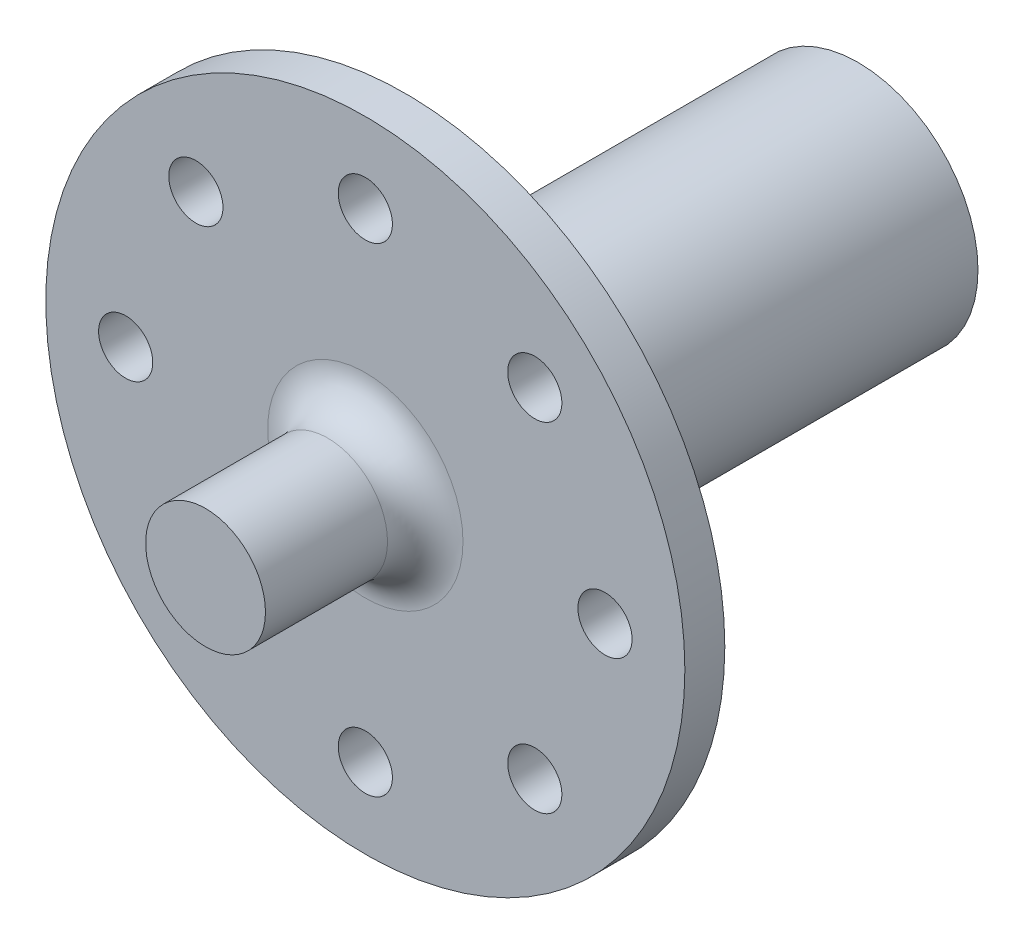
ISO-10303-21;
HEADER;
FILE_DESCRIPTION(('STEP AP214'),'2;1');
FILE_NAME('part.step','',(''),(''),'','','');
FILE_SCHEMA(('AUTOMOTIVE_DESIGN { 1 0 10303 214 1 1 1 1 }'));
ENDSEC;
DATA;
#1=APPLICATION_CONTEXT('core data for automotive mechanical design processes');
#2=APPLICATION_PROTOCOL_DEFINITION('international standard','automotive_design',2000,#1);
#3=PRODUCT_CONTEXT('',#1,'mechanical');
#4=PRODUCT('Part','Part','',(#3));
#5=PRODUCT_RELATED_PRODUCT_CATEGORY('part','',(#4));
#6=PRODUCT_DEFINITION_FORMATION('','',#4);
#7=PRODUCT_DEFINITION_CONTEXT('part definition',#1,'design');
#8=PRODUCT_DEFINITION('design','',#6,#7);
#9=PRODUCT_DEFINITION_SHAPE('','',#8);
#10=(LENGTH_UNIT() NAMED_UNIT(*) SI_UNIT(.MILLI.,.METRE.));
#11=(NAMED_UNIT(*) PLANE_ANGLE_UNIT() SI_UNIT($,.RADIAN.));
#12=(NAMED_UNIT(*) SI_UNIT($,.STERADIAN.) SOLID_ANGLE_UNIT());
#13=UNCERTAINTY_MEASURE_WITH_UNIT(LENGTH_MEASURE(1.E-05),#10,'distance_accuracy_value','');
#14=(GEOMETRIC_REPRESENTATION_CONTEXT(3) GLOBAL_UNCERTAINTY_ASSIGNED_CONTEXT((#13)) GLOBAL_UNIT_ASSIGNED_CONTEXT((#10,
#11,#12)) REPRESENTATION_CONTEXT('',''));
#15=CARTESIAN_POINT('',(0.,0.,0.));
#16=DIRECTION('',(0.,0.,1.));
#17=DIRECTION('',(1.,0.,0.));
#18=AXIS2_PLACEMENT_3D('',#15,#16,#17);
#19=CARTESIAN_POINT('',(-1.5,5.2,36.));
#20=DIRECTION('',(1.,0.,0.));
#21=DIRECTION('',(0.,0.,-1.));
#22=AXIS2_PLACEMENT_3D('',#19,#20,#21);
#23=PLANE('',#22);
#24=DIRECTION('',(0.,0.,-1.));
#25=VECTOR('',#24,1.);
#26=CARTESIAN_POINT('',(-1.5,5.2,36.));
#27=LINE('',#26,#25);
#28=CARTESIAN_POINT('',(-1.5,5.2,25.4));
#29=VERTEX_POINT('',#28);
#30=CARTESIAN_POINT('',(-1.5,5.2,0.));
#31=VERTEX_POINT('',#30);
#32=EDGE_CURVE('E108',#29,#31,#27,.T.);
#33=ORIENTED_EDGE('',*,*,#32,.F.);
#34=DIRECTION('',(0.,-1.,0.));
#35=VECTOR('',#34,1.);
#36=CARTESIAN_POINT('',(-1.5,5.2,25.4));
#37=LINE('',#36,#35);
#38=CARTESIAN_POINT('',(-1.5,3.70809924354783,25.4));
#39=VERTEX_POINT('',#38);
#40=EDGE_CURVE('E57',#29,#39,#37,.T.);
#41=ORIENTED_EDGE('',*,*,#40,.T.);
#42=DIRECTION('',(0.,0.,-1.));
#43=VECTOR('',#42,1.);
#44=CARTESIAN_POINT('',(-1.5,3.70809924354783,36.));
#45=LINE('',#44,#43);
#46=CARTESIAN_POINT('',(-1.5,3.70809924354783,0.));
#47=VERTEX_POINT('',#46);
#48=EDGE_CURVE('E96',#39,#47,#45,.T.);
#49=ORIENTED_EDGE('',*,*,#48,.T.);
#50=DIRECTION('',(0.,-1.,0.));
#51=VECTOR('',#50,1.);
#52=CARTESIAN_POINT('',(-1.5,5.2,0.));
#53=LINE('',#52,#51);
#54=EDGE_CURVE('E195',#31,#47,#53,.T.);
#55=ORIENTED_EDGE('',*,*,#54,.F.);
#56=EDGE_LOOP('',(#33,#41,#49,#55));
#57=FACE_BOUND('',#56,.T.);
#58=ADVANCED_FACE('F41',(#57),#23,.T.);
#59=CARTESIAN_POINT('',(1.5,5.2,36.));
#60=DIRECTION('',(-1.,0.,0.));
#61=DIRECTION('',(0.,0.,1.));
#62=AXIS2_PLACEMENT_3D('',#59,#60,#61);
#63=PLANE('',#62);
#64=DIRECTION('',(0.,0.,-1.));
#65=VECTOR('',#64,1.);
#66=CARTESIAN_POINT('',(1.5,3.70809924354783,36.));
#67=LINE('',#66,#65);
#68=CARTESIAN_POINT('',(1.5,3.70809924354783,25.4));
#69=VERTEX_POINT('',#68);
#70=CARTESIAN_POINT('',(1.5,3.70809924354783,0.));
#71=VERTEX_POINT('',#70);
#72=EDGE_CURVE('E65',#69,#71,#67,.T.);
#73=ORIENTED_EDGE('',*,*,#72,.F.);
#74=DIRECTION('',(0.,1.,0.));
#75=VECTOR('',#74,1.);
#76=CARTESIAN_POINT('',(1.5,3.70809924354783,25.4));
#77=LINE('',#76,#75);
#78=CARTESIAN_POINT('',(1.5,5.2,25.4));
#79=VERTEX_POINT('',#78);
#80=EDGE_CURVE('E276',#69,#79,#77,.T.);
#81=ORIENTED_EDGE('',*,*,#80,.T.);
#82=DIRECTION('',(0.,0.,-1.));
#83=VECTOR('',#82,1.);
#84=CARTESIAN_POINT('',(1.5,5.2,36.));
#85=LINE('',#84,#83);
#86=CARTESIAN_POINT('',(1.5,5.2,0.));
#87=VERTEX_POINT('',#86);
#88=EDGE_CURVE('E215',#79,#87,#85,.T.);
#89=ORIENTED_EDGE('',*,*,#88,.T.);
#90=DIRECTION('',(0.,1.,0.));
#91=VECTOR('',#90,1.);
#92=CARTESIAN_POINT('',(1.5,5.2,0.));
#93=LINE('',#92,#91);
#94=EDGE_CURVE('E206',#71,#87,#93,.T.);
#95=ORIENTED_EDGE('',*,*,#94,.F.);
#96=EDGE_LOOP('',(#73,#81,#89,#95));
#97=FACE_BOUND('',#96,.T.);
#98=ADVANCED_FACE('F247',(#97),#63,.T.);
#99=CARTESIAN_POINT('',(-1.5,5.2,36.));
#100=DIRECTION('',(0.,-1.,0.));
#101=DIRECTION('',(0.,0.,-1.));
#102=AXIS2_PLACEMENT_3D('',#99,#100,#101);
#103=PLANE('',#102);
#104=ORIENTED_EDGE('',*,*,#88,.F.);
#105=DIRECTION('',(-1.,0.,0.));
#106=VECTOR('',#105,1.);
#107=CARTESIAN_POINT('',(1.5,5.2,25.4));
#108=LINE('',#107,#106);
#109=EDGE_CURVE('E119',#79,#29,#108,.T.);
#110=ORIENTED_EDGE('',*,*,#109,.T.);
#111=ORIENTED_EDGE('',*,*,#32,.T.);
#112=DIRECTION('',(-1.,0.,0.));
#113=VECTOR('',#112,1.);
#114=CARTESIAN_POINT('',(-1.5,5.2,0.));
#115=LINE('',#114,#113);
#116=EDGE_CURVE('E109',#87,#31,#115,.T.);
#117=ORIENTED_EDGE('',*,*,#116,.F.);
#118=EDGE_LOOP('',(#104,#110,#111,#117));
#119=FACE_BOUND('',#118,.T.);
#120=ADVANCED_FACE('F252',(#119),#103,.T.);
#121=CARTESIAN_POINT('',(0.,0.,36.));
#122=DIRECTION('',(0.,0.,1.));
#123=DIRECTION('',(1.,0.,0.));
#124=AXIS2_PLACEMENT_3D('',#121,#122,#123);
#125=PLANE('',#124);
#126=DIRECTION('',(-1.,0.,0.));
#127=VECTOR('',#126,1.);
#128=CARTESIAN_POINT('',(1.5,3.70809924354783,36.));
#129=LINE('',#128,#127);
#130=CARTESIAN_POINT('',(1.5,3.70809924354783,36.));
#131=VERTEX_POINT('',#130);
#132=CARTESIAN_POINT('',(-1.5,3.70809924354783,36.));
#133=VERTEX_POINT('',#132);
#134=EDGE_CURVE('E106',#131,#133,#129,.T.);
#135=ORIENTED_EDGE('',*,*,#134,.F.);
#136=CARTESIAN_POINT('',(0.,0.,36.));
#137=DIRECTION('',(0.,0.,1.));
#138=DIRECTION('',(1.,0.,0.));
#139=AXIS2_PLACEMENT_3D('',#136,#137,#138);
#140=CIRCLE('',#139,4.);
#141=EDGE_CURVE('E94',#133,#131,#140,.T.);
#142=ORIENTED_EDGE('',*,*,#141,.F.);
#143=EDGE_LOOP('',(#135,#142));
#144=FACE_BOUND('',#143,.T.);
#145=ADVANCED_FACE('F105',(#144),#125,.F.);
#146=CARTESIAN_POINT('',(0.,0.,0.));
#147=DIRECTION('',(0.,0.,1.));
#148=DIRECTION('',(1.,0.,0.));
#149=AXIS2_PLACEMENT_3D('',#146,#147,#148);
#150=PLANE('',#149);
#151=CARTESIAN_POINT('',(0.,0.,0.));
#152=DIRECTION('',(0.,0.,1.));
#153=DIRECTION('',(1.,0.,0.));
#154=AXIS2_PLACEMENT_3D('',#151,#152,#153);
#155=CIRCLE('',#154,9.525);
#156=CARTESIAN_POINT('',(9.525,0.,0.));
#157=VERTEX_POINT('',#156);
#158=EDGE_CURVE('E102',#157,#157,#155,.T.);
#159=ORIENTED_EDGE('',*,*,#158,.F.);
#160=EDGE_LOOP('',(#159));
#161=FACE_BOUND('',#160,.T.);
#162=ORIENTED_EDGE('',*,*,#54,.T.);
#163=CARTESIAN_POINT('',(0.,0.,0.));
#164=DIRECTION('',(0.,0.,1.));
#165=DIRECTION('',(1.,0.,0.));
#166=AXIS2_PLACEMENT_3D('',#163,#164,#165);
#167=CIRCLE('',#166,4.);
#168=EDGE_CURVE('E202',#47,#71,#167,.T.);
#169=ORIENTED_EDGE('',*,*,#168,.T.);
#170=ORIENTED_EDGE('',*,*,#94,.T.);
#171=ORIENTED_EDGE('',*,*,#116,.T.);
#172=EDGE_LOOP('',(#162,#169,#170,#171));
#173=FACE_BOUND('',#172,.T.);
#174=ADVANCED_FACE('F256',(#161,#173),#150,.F.);
#175=CARTESIAN_POINT('',(0.,0.,36.));
#176=DIRECTION('',(0.,0.,-1.));
#177=DIRECTION('',(-1.,0.,0.));
#178=AXIS2_PLACEMENT_3D('',#175,#176,#177);
#179=CYLINDRICAL_SURFACE('',#178,9.525);
#180=CARTESIAN_POINT('',(0.,0.,36.));
#181=DIRECTION('',(0.,0.,1.));
#182=DIRECTION('',(1.,0.,0.));
#183=AXIS2_PLACEMENT_3D('',#180,#181,#182);
#184=CIRCLE('',#183,9.525);
#185=CARTESIAN_POINT('',(9.525,0.,36.));
#186=VERTEX_POINT('',#185);
#187=EDGE_CURVE('E220',#186,#186,#184,.T.);
#188=ORIENTED_EDGE('',*,*,#187,.F.);
#189=EDGE_LOOP('',(#188));
#190=FACE_BOUND('',#189,.T.);
#191=ORIENTED_EDGE('',*,*,#158,.T.);
#192=EDGE_LOOP('',(#191));
#193=FACE_BOUND('',#192,.T.);
#194=ADVANCED_FACE('F258',(#190,#193),#179,.T.);
#195=CARTESIAN_POINT('',(0.,0.,36.));
#196=DIRECTION('',(0.,0.,-1.));
#197=DIRECTION('',(-1.,0.,0.));
#198=AXIS2_PLACEMENT_3D('',#195,#196,#197);
#199=CYLINDRICAL_SURFACE('',#198,4.);
#200=ORIENTED_EDGE('',*,*,#168,.F.);
#201=ORIENTED_EDGE('',*,*,#48,.F.);
#202=EDGE_CURVE('E90',#133,#39,#45,.T.);
#203=ORIENTED_EDGE('',*,*,#202,.F.);
#204=ORIENTED_EDGE('',*,*,#141,.T.);
#205=EDGE_CURVE('E112',#131,#69,#67,.T.);
#206=ORIENTED_EDGE('',*,*,#205,.T.);
#207=ORIENTED_EDGE('',*,*,#72,.T.);
#208=EDGE_LOOP('',(#200,#201,#203,#204,#206,#207));
#209=FACE_BOUND('',#208,.T.);
#210=ADVANCED_FACE('F93',(#209),#199,.F.);
#211=CARTESIAN_POINT('',(0.,19.05,36.));
#212=DIRECTION('',(0.,0.,1.));
#213=DIRECTION('',(1.,0.,0.));
#214=AXIS2_PLACEMENT_3D('',#211,#212,#213);
#215=CIRCLE('',#214,2.15265);
#216=CARTESIAN_POINT('',(2.15265,19.05,36.));
#217=VERTEX_POINT('',#216);
#218=EDGE_CURVE('E182',#217,#217,#215,.T.);
#219=ORIENTED_EDGE('',*,*,#218,.T.);
#220=EDGE_LOOP('',(#219));
#221=FACE_BOUND('',#220,.T.);
#222=CARTESIAN_POINT('',(-13.4703841816037,13.4703841816038,36.));
#223=DIRECTION('',(0.,0.,1.));
#224=DIRECTION('',(1.,0.,0.));
#225=AXIS2_PLACEMENT_3D('',#222,#223,#224);
#226=CIRCLE('',#225,2.15265);
#227=CARTESIAN_POINT('',(-11.3177341816037,13.4703841816038,36.));
#228=VERTEX_POINT('',#227);
#229=EDGE_CURVE('E178',#228,#228,#226,.T.);
#230=ORIENTED_EDGE('',*,*,#229,.T.);
#231=EDGE_LOOP('',(#230));
#232=FACE_BOUND('',#231,.T.);
#233=CARTESIAN_POINT('',(-13.4703841816037,-13.4703841816038,36.));
#234=DIRECTION('',(0.,0.,1.));
#235=DIRECTION('',(1.,0.,0.));
#236=AXIS2_PLACEMENT_3D('',#233,#234,#235);
#237=CIRCLE('',#236,2.15265);
#238=CARTESIAN_POINT('',(-11.3177341816037,-13.4703841816038,36.));
#239=VERTEX_POINT('',#238);
#240=EDGE_CURVE('E174',#239,#239,#237,.T.);
#241=ORIENTED_EDGE('',*,*,#240,.T.);
#242=EDGE_LOOP('',(#241));
#243=FACE_BOUND('',#242,.T.);
#244=CARTESIAN_POINT('',(0.,-19.05,36.));
#245=DIRECTION('',(0.,0.,1.));
#246=DIRECTION('',(1.,0.,0.));
#247=AXIS2_PLACEMENT_3D('',#244,#245,#246);
#248=CIRCLE('',#247,2.15265);
#249=CARTESIAN_POINT('',(2.15265,-19.05,36.));
#250=VERTEX_POINT('',#249);
#251=EDGE_CURVE('E170',#250,#250,#248,.T.);
#252=ORIENTED_EDGE('',*,*,#251,.T.);
#253=EDGE_LOOP('',(#252));
#254=FACE_BOUND('',#253,.T.);
#255=CARTESIAN_POINT('',(13.4703841816037,13.4703841816038,36.));
#256=DIRECTION('',(0.,0.,1.));
#257=DIRECTION('',(1.,0.,0.));
#258=AXIS2_PLACEMENT_3D('',#255,#256,#257);
#259=CIRCLE('',#258,2.15265);
#260=CARTESIAN_POINT('',(15.6230341816037,13.4703841816038,36.));
#261=VERTEX_POINT('',#260);
#262=EDGE_CURVE('E166',#261,#261,#259,.T.);
#263=ORIENTED_EDGE('',*,*,#262,.T.);
#264=EDGE_LOOP('',(#263));
#265=FACE_BOUND('',#264,.T.);
#266=CARTESIAN_POINT('',(19.05,0.,36.));
#267=DIRECTION('',(0.,0.,1.));
#268=DIRECTION('',(1.,0.,0.));
#269=AXIS2_PLACEMENT_3D('',#266,#267,#268);
#270=CIRCLE('',#269,2.15265);
#271=CARTESIAN_POINT('',(21.20265,0.,36.));
#272=VERTEX_POINT('',#271);
#273=EDGE_CURVE('E162',#272,#272,#270,.T.);
#274=ORIENTED_EDGE('',*,*,#273,.T.);
#275=EDGE_LOOP('',(#274));
#276=FACE_BOUND('',#275,.T.);
#277=CARTESIAN_POINT('',(13.4703841816037,-13.4703841816038,36.));
#278=DIRECTION('',(0.,0.,1.));
#279=DIRECTION('',(1.,0.,0.));
#280=AXIS2_PLACEMENT_3D('',#277,#278,#279);
#281=CIRCLE('',#280,2.15265);
#282=CARTESIAN_POINT('',(15.6230341816037,-13.4703841816038,36.));
#283=VERTEX_POINT('',#282);
#284=EDGE_CURVE('E158',#283,#283,#281,.T.);
#285=ORIENTED_EDGE('',*,*,#284,.T.);
#286=EDGE_LOOP('',(#285));
#287=FACE_BOUND('',#286,.T.);
#288=CARTESIAN_POINT('',(-19.05,0.,36.));
#289=DIRECTION('',(0.,0.,1.));
#290=DIRECTION('',(1.,0.,0.));
#291=AXIS2_PLACEMENT_3D('',#288,#289,#290);
#292=CIRCLE('',#291,2.15265);
#293=CARTESIAN_POINT('',(-16.89735,0.,36.));
#294=VERTEX_POINT('',#293);
#295=EDGE_CURVE('E126',#294,#294,#292,.T.);
#296=ORIENTED_EDGE('',*,*,#295,.T.);
#297=EDGE_LOOP('',(#296));
#298=FACE_BOUND('',#297,.T.);
#299=CARTESIAN_POINT('',(0.,0.,36.));
#300=DIRECTION('',(0.,0.,1.));
#301=DIRECTION('',(1.,0.,0.));
#302=AXIS2_PLACEMENT_3D('',#299,#300,#301);
#303=CIRCLE('',#302,25.4);
#304=CARTESIAN_POINT('',(25.4,0.,36.));
#305=VERTEX_POINT('',#304);
#306=EDGE_CURVE('E190',#305,#305,#303,.T.);
#307=ORIENTED_EDGE('',*,*,#306,.F.);
#308=EDGE_LOOP('',(#307));
#309=FACE_BOUND('',#308,.T.);
#310=ORIENTED_EDGE('',*,*,#187,.T.);
#311=EDGE_LOOP('',(#310));
#312=FACE_BOUND('',#311,.T.);
#313=ADVANCED_FACE('F265',(#221,#232,#243,#254,#265,#276,#287,#298,#309,#312),#125,.F.);
#314=CARTESIAN_POINT('',(0.,0.,39.175));
#315=DIRECTION('',(0.,0.,-1.));
#316=DIRECTION('',(-1.,0.,0.));
#317=AXIS2_PLACEMENT_3D('',#314,#315,#316);
#318=CYLINDRICAL_SURFACE('',#317,25.4);
#319=CARTESIAN_POINT('',(0.,0.,39.175));
#320=DIRECTION('',(0.,0.,1.));
#321=DIRECTION('',(1.,0.,0.));
#322=AXIS2_PLACEMENT_3D('',#319,#320,#321);
#323=CIRCLE('',#322,25.4);
#324=CARTESIAN_POINT('',(25.4,0.,39.175));
#325=VERTEX_POINT('',#324);
#326=EDGE_CURVE('E191',#325,#325,#323,.T.);
#327=ORIENTED_EDGE('',*,*,#326,.F.);
#328=EDGE_LOOP('',(#327));
#329=FACE_BOUND('',#328,.T.);
#330=ORIENTED_EDGE('',*,*,#306,.T.);
#331=EDGE_LOOP('',(#330));
#332=FACE_BOUND('',#331,.T.);
#333=ADVANCED_FACE('F325',(#329,#332),#318,.T.);
#334=CARTESIAN_POINT('',(0.,0.,39.175));
#335=DIRECTION('',(0.,0.,1.));
#336=DIRECTION('',(1.,0.,0.));
#337=AXIS2_PLACEMENT_3D('',#334,#335,#336);
#338=PLANE('',#337);
#339=CARTESIAN_POINT('',(0.,0.,39.175));
#340=DIRECTION('',(0.,0.,1.));
#341=DIRECTION('',(1.,0.,0.));
#342=AXIS2_PLACEMENT_3D('',#339,#340,#341);
#343=CIRCLE('',#342,7.7625);
#344=CARTESIAN_POINT('',(7.7625,0.,39.175));
#345=VERTEX_POINT('',#344);
#346=EDGE_CURVE('E12',#345,#345,#343,.F.);
#347=ORIENTED_EDGE('',*,*,#346,.T.);
#348=EDGE_LOOP('',(#347));
#349=FACE_BOUND('',#348,.T.);
#350=CARTESIAN_POINT('',(0.,19.05,39.175));
#351=DIRECTION('',(0.,0.,1.));
#352=DIRECTION('',(1.,0.,0.));
#353=AXIS2_PLACEMENT_3D('',#350,#351,#352);
#354=CIRCLE('',#353,2.15265);
#355=CARTESIAN_POINT('',(2.15265,19.05,39.175));
#356=VERTEX_POINT('',#355);
#357=EDGE_CURVE('E122',#356,#356,#354,.T.);
#358=ORIENTED_EDGE('',*,*,#357,.F.);
#359=EDGE_LOOP('',(#358));
#360=FACE_BOUND('',#359,.T.);
#361=CARTESIAN_POINT('',(-13.4703841816037,13.4703841816038,39.175));
#362=DIRECTION('',(0.,0.,1.));
#363=DIRECTION('',(1.,0.,0.));
#364=AXIS2_PLACEMENT_3D('',#361,#362,#363);
#365=CIRCLE('',#364,2.15265);
#366=CARTESIAN_POINT('',(-11.3177341816037,13.4703841816038,39.175));
#367=VERTEX_POINT('',#366);
#368=EDGE_CURVE('E137',#367,#367,#365,.T.);
#369=ORIENTED_EDGE('',*,*,#368,.F.);
#370=EDGE_LOOP('',(#369));
#371=FACE_BOUND('',#370,.T.);
#372=CARTESIAN_POINT('',(-13.4703841816037,-13.4703841816038,39.175));
#373=DIRECTION('',(0.,0.,1.));
#374=DIRECTION('',(1.,0.,0.));
#375=AXIS2_PLACEMENT_3D('',#372,#373,#374);
#376=CIRCLE('',#375,2.15265);
#377=CARTESIAN_POINT('',(-11.3177341816037,-13.4703841816038,39.175));
#378=VERTEX_POINT('',#377);
#379=EDGE_CURVE('E133',#378,#378,#376,.T.);
#380=ORIENTED_EDGE('',*,*,#379,.F.);
#381=EDGE_LOOP('',(#380));
#382=FACE_BOUND('',#381,.T.);
#383=CARTESIAN_POINT('',(0.,-19.05,39.175));
#384=DIRECTION('',(0.,0.,1.));
#385=DIRECTION('',(1.,0.,0.));
#386=AXIS2_PLACEMENT_3D('',#383,#384,#385);
#387=CIRCLE('',#386,2.15265);
#388=CARTESIAN_POINT('',(2.15265,-19.05,39.175));
#389=VERTEX_POINT('',#388);
#390=EDGE_CURVE('E128',#389,#389,#387,.T.);
#391=ORIENTED_EDGE('',*,*,#390,.F.);
#392=EDGE_LOOP('',(#391));
#393=FACE_BOUND('',#392,.T.);
#394=CARTESIAN_POINT('',(13.4703841816037,13.4703841816038,39.175));
#395=DIRECTION('',(0.,0.,1.));
#396=DIRECTION('',(1.,0.,0.));
#397=AXIS2_PLACEMENT_3D('',#394,#395,#396);
#398=CIRCLE('',#397,2.15265);
#399=CARTESIAN_POINT('',(15.6230341816037,13.4703841816038,39.175));
#400=VERTEX_POINT('',#399);
#401=EDGE_CURVE('E127',#400,#400,#398,.T.);
#402=ORIENTED_EDGE('',*,*,#401,.F.);
#403=EDGE_LOOP('',(#402));
#404=FACE_BOUND('',#403,.T.);
#405=CARTESIAN_POINT('',(19.05,0.,39.175));
#406=DIRECTION('',(0.,0.,1.));
#407=DIRECTION('',(1.,0.,0.));
#408=AXIS2_PLACEMENT_3D('',#405,#406,#407);
#409=CIRCLE('',#408,2.15265);
#410=CARTESIAN_POINT('',(21.20265,0.,39.175));
#411=VERTEX_POINT('',#410);
#412=EDGE_CURVE('E145',#411,#411,#409,.T.);
#413=ORIENTED_EDGE('',*,*,#412,.F.);
#414=EDGE_LOOP('',(#413));
#415=FACE_BOUND('',#414,.T.);
#416=CARTESIAN_POINT('',(13.4703841816037,-13.4703841816038,39.175));
#417=DIRECTION('',(0.,0.,1.));
#418=DIRECTION('',(1.,0.,0.));
#419=AXIS2_PLACEMENT_3D('',#416,#417,#418);
#420=CIRCLE('',#419,2.15265);
#421=CARTESIAN_POINT('',(15.6230341816037,-13.4703841816038,39.175));
#422=VERTEX_POINT('',#421);
#423=EDGE_CURVE('E141',#422,#422,#420,.T.);
#424=ORIENTED_EDGE('',*,*,#423,.F.);
#425=EDGE_LOOP('',(#424));
#426=FACE_BOUND('',#425,.T.);
#427=CARTESIAN_POINT('',(-19.05,0.,39.175));
#428=DIRECTION('',(0.,0.,1.));
#429=DIRECTION('',(1.,0.,0.));
#430=AXIS2_PLACEMENT_3D('',#427,#428,#429);
#431=CIRCLE('',#430,2.15265);
#432=CARTESIAN_POINT('',(-16.89735,0.,39.175));
#433=VERTEX_POINT('',#432);
#434=EDGE_CURVE('E132',#433,#433,#431,.T.);
#435=ORIENTED_EDGE('',*,*,#434,.F.);
#436=EDGE_LOOP('',(#435));
#437=FACE_BOUND('',#436,.T.);
#438=ORIENTED_EDGE('',*,*,#326,.T.);
#439=EDGE_LOOP('',(#438));
#440=FACE_BOUND('',#439,.T.);
#441=ADVANCED_FACE('F322',(#349,#360,#371,#382,#393,#404,#415,#426,#437,#440),#338,.T.);
#442=CARTESIAN_POINT('',(0.,0.,51.875));
#443=DIRECTION('',(0.,0.,-1.));
#444=DIRECTION('',(-1.,0.,0.));
#445=AXIS2_PLACEMENT_3D('',#442,#443,#444);
#446=CYLINDRICAL_SURFACE('',#445,4.7625);
#447=CARTESIAN_POINT('',(0.,0.,42.175));
#448=DIRECTION('',(0.,0.,1.));
#449=DIRECTION('',(1.,0.,0.));
#450=AXIS2_PLACEMENT_3D('',#447,#448,#449);
#451=CIRCLE('',#450,4.7625);
#452=CARTESIAN_POINT('',(4.7625,0.,42.175));
#453=VERTEX_POINT('',#452);
#454=EDGE_CURVE('E50',#453,#453,#451,.T.);
#455=ORIENTED_EDGE('',*,*,#454,.T.);
#456=EDGE_LOOP('',(#455));
#457=FACE_BOUND('',#456,.T.);
#458=CARTESIAN_POINT('',(0.,0.,51.875));
#459=DIRECTION('',(0.,0.,1.));
#460=DIRECTION('',(1.,0.,0.));
#461=AXIS2_PLACEMENT_3D('',#458,#459,#460);
#462=CIRCLE('',#461,4.7625);
#463=CARTESIAN_POINT('',(4.7625,0.,51.875));
#464=VERTEX_POINT('',#463);
#465=EDGE_CURVE('E186',#464,#464,#462,.T.);
#466=ORIENTED_EDGE('',*,*,#465,.F.);
#467=EDGE_LOOP('',(#466));
#468=FACE_BOUND('',#467,.T.);
#469=ADVANCED_FACE('F230',(#457,#468),#446,.T.);
#470=CARTESIAN_POINT('',(0.,0.,51.875));
#471=DIRECTION('',(0.,0.,1.));
#472=DIRECTION('',(1.,0.,0.));
#473=AXIS2_PLACEMENT_3D('',#470,#471,#472);
#474=PLANE('',#473);
#475=ORIENTED_EDGE('',*,*,#465,.T.);
#476=EDGE_LOOP('',(#475));
#477=FACE_BOUND('',#476,.T.);
#478=ADVANCED_FACE('F309',(#477),#474,.T.);
#479=CARTESIAN_POINT('',(-19.05,0.,20.125));
#480=DIRECTION('',(0.,0.,1.));
#481=DIRECTION('',(1.,0.,0.));
#482=AXIS2_PLACEMENT_3D('',#479,#480,#481);
#483=CYLINDRICAL_SURFACE('',#482,2.15265);
#484=ORIENTED_EDGE('',*,*,#434,.T.);
#485=EDGE_LOOP('',(#484));
#486=FACE_BOUND('',#485,.T.);
#487=ORIENTED_EDGE('',*,*,#295,.F.);
#488=EDGE_LOOP('',(#487));
#489=FACE_BOUND('',#488,.T.);
#490=ADVANCED_FACE('F305',(#486,#489),#483,.F.);
#491=CARTESIAN_POINT('',(13.4703841816037,-13.4703841816038,20.125));
#492=DIRECTION('',(0.,0.,1.));
#493=DIRECTION('',(1.,0.,0.));
#494=AXIS2_PLACEMENT_3D('',#491,#492,#493);
#495=CYLINDRICAL_SURFACE('',#494,2.15265);
#496=ORIENTED_EDGE('',*,*,#423,.T.);
#497=EDGE_LOOP('',(#496));
#498=FACE_BOUND('',#497,.T.);
#499=ORIENTED_EDGE('',*,*,#284,.F.);
#500=EDGE_LOOP('',(#499));
#501=FACE_BOUND('',#500,.T.);
#502=ADVANCED_FACE('F301',(#498,#501),#495,.F.);
#503=CARTESIAN_POINT('',(19.05,0.,20.125));
#504=DIRECTION('',(0.,0.,1.));
#505=DIRECTION('',(1.,0.,0.));
#506=AXIS2_PLACEMENT_3D('',#503,#504,#505);
#507=CYLINDRICAL_SURFACE('',#506,2.15265);
#508=ORIENTED_EDGE('',*,*,#412,.T.);
#509=EDGE_LOOP('',(#508));
#510=FACE_BOUND('',#509,.T.);
#511=ORIENTED_EDGE('',*,*,#273,.F.);
#512=EDGE_LOOP('',(#511));
#513=FACE_BOUND('',#512,.T.);
#514=ADVANCED_FACE('F304',(#510,#513),#507,.F.);
#515=CARTESIAN_POINT('',(13.4703841816037,13.4703841816038,20.125));
#516=DIRECTION('',(0.,0.,1.));
#517=DIRECTION('',(1.,0.,0.));
#518=AXIS2_PLACEMENT_3D('',#515,#516,#517);
#519=CYLINDRICAL_SURFACE('',#518,2.15265);
#520=ORIENTED_EDGE('',*,*,#401,.T.);
#521=EDGE_LOOP('',(#520));
#522=FACE_BOUND('',#521,.T.);
#523=ORIENTED_EDGE('',*,*,#262,.F.);
#524=EDGE_LOOP('',(#523));
#525=FACE_BOUND('',#524,.T.);
#526=ADVANCED_FACE('F293',(#522,#525),#519,.F.);
#527=CARTESIAN_POINT('',(0.,-19.05,20.125));
#528=DIRECTION('',(0.,0.,1.));
#529=DIRECTION('',(1.,0.,0.));
#530=AXIS2_PLACEMENT_3D('',#527,#528,#529);
#531=CYLINDRICAL_SURFACE('',#530,2.15265);
#532=ORIENTED_EDGE('',*,*,#390,.T.);
#533=EDGE_LOOP('',(#532));
#534=FACE_BOUND('',#533,.T.);
#535=ORIENTED_EDGE('',*,*,#251,.F.);
#536=EDGE_LOOP('',(#535));
#537=FACE_BOUND('',#536,.T.);
#538=ADVANCED_FACE('F289',(#534,#537),#531,.F.);
#539=CARTESIAN_POINT('',(-13.4703841816037,-13.4703841816038,20.125));
#540=DIRECTION('',(0.,0.,1.));
#541=DIRECTION('',(1.,0.,0.));
#542=AXIS2_PLACEMENT_3D('',#539,#540,#541);
#543=CYLINDRICAL_SURFACE('',#542,2.15265);
#544=ORIENTED_EDGE('',*,*,#379,.T.);
#545=EDGE_LOOP('',(#544));
#546=FACE_BOUND('',#545,.T.);
#547=ORIENTED_EDGE('',*,*,#240,.F.);
#548=EDGE_LOOP('',(#547));
#549=FACE_BOUND('',#548,.T.);
#550=ADVANCED_FACE('F292',(#546,#549),#543,.F.);
#551=CARTESIAN_POINT('',(-13.4703841816037,13.4703841816038,20.125));
#552=DIRECTION('',(0.,0.,1.));
#553=DIRECTION('',(1.,0.,0.));
#554=AXIS2_PLACEMENT_3D('',#551,#552,#553);
#555=CYLINDRICAL_SURFACE('',#554,2.15265);
#556=ORIENTED_EDGE('',*,*,#368,.T.);
#557=EDGE_LOOP('',(#556));
#558=FACE_BOUND('',#557,.T.);
#559=ORIENTED_EDGE('',*,*,#229,.F.);
#560=EDGE_LOOP('',(#559));
#561=FACE_BOUND('',#560,.T.);
#562=ADVANCED_FACE('F242',(#558,#561),#555,.F.);
#563=CARTESIAN_POINT('',(0.,19.05,20.125));
#564=DIRECTION('',(0.,0.,1.));
#565=DIRECTION('',(1.,0.,0.));
#566=AXIS2_PLACEMENT_3D('',#563,#564,#565);
#567=CYLINDRICAL_SURFACE('',#566,2.15265);
#568=ORIENTED_EDGE('',*,*,#357,.T.);
#569=EDGE_LOOP('',(#568));
#570=FACE_BOUND('',#569,.T.);
#571=ORIENTED_EDGE('',*,*,#218,.F.);
#572=EDGE_LOOP('',(#571));
#573=FACE_BOUND('',#572,.T.);
#574=ADVANCED_FACE('F234',(#570,#573),#567,.F.);
#575=CARTESIAN_POINT('',(0.,0.,42.175));
#576=DIRECTION('',(0.,0.,1.));
#577=DIRECTION('',(1.,0.,0.));
#578=AXIS2_PLACEMENT_3D('',#575,#576,#577);
#579=TOROIDAL_SURFACE('',#578,7.7625,3.);
#580=ORIENTED_EDGE('',*,*,#346,.F.);
#581=EDGE_LOOP('',(#580));
#582=FACE_BOUND('',#581,.T.);
#583=ORIENTED_EDGE('',*,*,#454,.F.);
#584=EDGE_LOOP('',(#583));
#585=FACE_BOUND('',#584,.T.);
#586=ADVANCED_FACE('F43',(#582,#585),#579,.F.);
#587=CARTESIAN_POINT('',(1.5,3.70809924354783,-3.35048770585755));
#588=DIRECTION('',(0.,1.,0.));
#589=DIRECTION('',(0.,0.,1.));
#590=AXIS2_PLACEMENT_3D('',#587,#588,#589);
#591=PLANE('',#590);
#592=ORIENTED_EDGE('',*,*,#202,.T.);
#593=DIRECTION('',(1.,0.,0.));
#594=VECTOR('',#593,1.);
#595=CARTESIAN_POINT('',(1.5,3.70809924354783,25.4));
#596=LINE('',#595,#594);
#597=EDGE_CURVE('E116',#39,#69,#596,.T.);
#598=ORIENTED_EDGE('',*,*,#597,.T.);
#599=ORIENTED_EDGE('',*,*,#205,.F.);
#600=ORIENTED_EDGE('',*,*,#134,.T.);
#601=EDGE_LOOP('',(#592,#598,#599,#600));
#602=FACE_BOUND('',#601,.T.);
#603=ADVANCED_FACE('F111',(#602),#591,.F.);
#604=CARTESIAN_POINT('',(0.,0.,25.4));
#605=DIRECTION('',(0.,0.,1.));
#606=DIRECTION('',(1.,0.,0.));
#607=AXIS2_PLACEMENT_3D('',#604,#605,#606);
#608=PLANE('',#607);
#609=ORIENTED_EDGE('',*,*,#80,.F.);
#610=ORIENTED_EDGE('',*,*,#597,.F.);
#611=ORIENTED_EDGE('',*,*,#40,.F.);
#612=ORIENTED_EDGE('',*,*,#109,.F.);
#613=EDGE_LOOP('',(#609,#610,#611,#612));
#614=FACE_BOUND('',#613,.T.);
#615=ADVANCED_FACE('F240',(#614),#608,.F.);
#616=CLOSED_SHELL('',(#58,#98,#120,#145,#174,#194,#210,#313,#333,#441,#469,#478,#490,#502,#514,
#526,#538,#550,#562,#574,#586,#603,#615));
#617=MANIFOLD_SOLID_BREP('B2',#616);
#618=ADVANCED_BREP_SHAPE_REPRESENTATION('',(#18,#617),#14);
#619=SHAPE_DEFINITION_REPRESENTATION(#9,#618);
ENDSEC;
END-ISO-10303-21;
